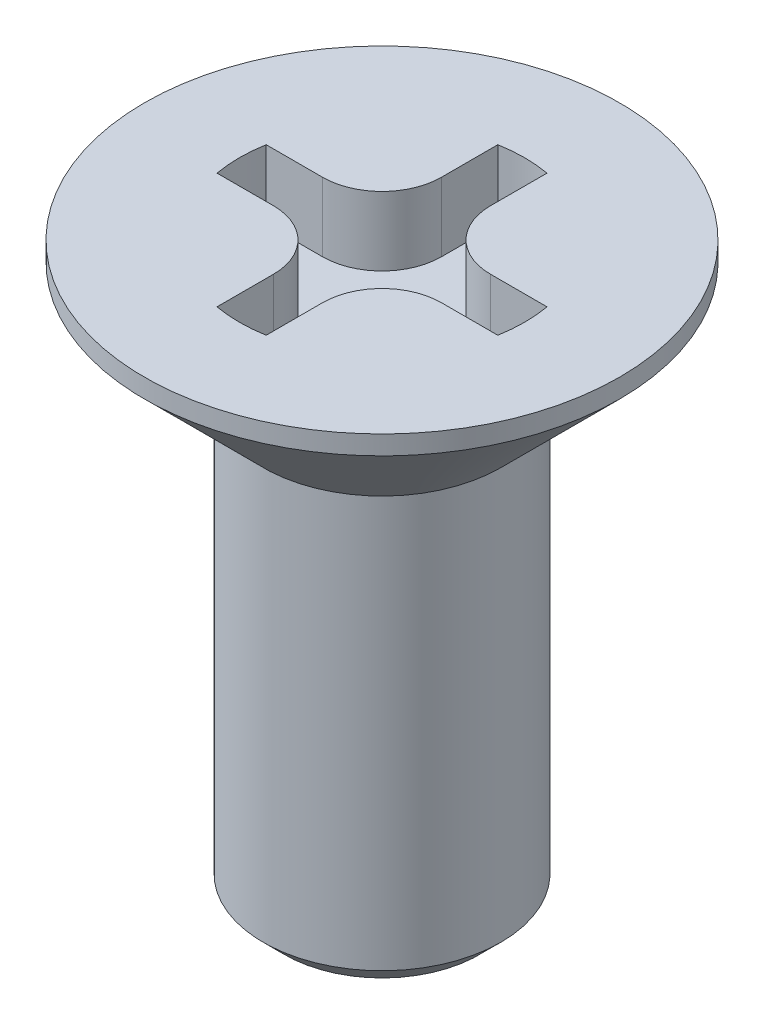
ISO-10303-21;
HEADER;
FILE_DESCRIPTION(('STEP AP214'),'2;1');
FILE_NAME('part.step','',(''),(''),'','','');
FILE_SCHEMA(('AUTOMOTIVE_DESIGN { 1 0 10303 214 1 1 1 1 }'));
ENDSEC;
DATA;
#1=APPLICATION_CONTEXT('core data for automotive mechanical design processes');
#2=APPLICATION_PROTOCOL_DEFINITION('international standard','automotive_design',2000,#1);
#3=PRODUCT_CONTEXT('',#1,'mechanical');
#4=PRODUCT('Part','Part','',(#3));
#5=PRODUCT_RELATED_PRODUCT_CATEGORY('part','',(#4));
#6=PRODUCT_DEFINITION_FORMATION('','',#4);
#7=PRODUCT_DEFINITION_CONTEXT('part definition',#1,'design');
#8=PRODUCT_DEFINITION('design','',#6,#7);
#9=PRODUCT_DEFINITION_SHAPE('','',#8);
#10=(LENGTH_UNIT() NAMED_UNIT(*) SI_UNIT(.MILLI.,.METRE.));
#11=(NAMED_UNIT(*) PLANE_ANGLE_UNIT() SI_UNIT($,.RADIAN.));
#12=(NAMED_UNIT(*) SI_UNIT($,.STERADIAN.) SOLID_ANGLE_UNIT());
#13=UNCERTAINTY_MEASURE_WITH_UNIT(LENGTH_MEASURE(1.E-05),#10,'distance_accuracy_value','');
#14=(GEOMETRIC_REPRESENTATION_CONTEXT(3) GLOBAL_UNCERTAINTY_ASSIGNED_CONTEXT((#13)) GLOBAL_UNIT_ASSIGNED_CONTEXT((#10,
#11,#12)) REPRESENTATION_CONTEXT('',''));
#15=CARTESIAN_POINT('',(0.,0.,0.));
#16=DIRECTION('',(0.,0.,1.));
#17=DIRECTION('',(1.,0.,0.));
#18=AXIS2_PLACEMENT_3D('',#15,#16,#17);
#19=CARTESIAN_POINT('',(0.,0.725,0.));
#20=DIRECTION('',(0.,-1.,0.));
#21=DIRECTION('',(0.,0.,-1.));
#22=AXIS2_PLACEMENT_3D('',#19,#20,#21);
#23=PLANE('',#22);
#24=DIRECTION('',(-1.,0.,0.));
#25=VECTOR('',#24,1.);
#26=CARTESIAN_POINT('',(-0.8838834764832,0.725,0.2588834764832));
#27=LINE('',#26,#25);
#28=CARTESIAN_POINT('',(-0.8838834764832,0.725,0.2588834764832));
#29=VERTEX_POINT('',#28);
#30=CARTESIAN_POINT('',(-1.477490895269,0.725,0.2588834764832));
#31=VERTEX_POINT('',#30);
#32=EDGE_CURVE('E207',#29,#31,#27,.T.);
#33=ORIENTED_EDGE('',*,*,#32,.F.);
#34=CARTESIAN_POINT('',(-0.8838834764832,0.725,0.8838834764832));
#35=DIRECTION('',(0.,1.,0.));
#36=DIRECTION('',(1.,0.,0.));
#37=AXIS2_PLACEMENT_3D('',#34,#35,#36);
#38=CIRCLE('',#37,0.625);
#39=CARTESIAN_POINT('',(-0.2588834764832,0.725,0.8838834764832));
#40=VERTEX_POINT('',#39);
#41=EDGE_CURVE('E11',#40,#29,#38,.T.);
#42=ORIENTED_EDGE('',*,*,#41,.F.);
#43=DIRECTION('',(0.,0.,-1.));
#44=VECTOR('',#43,1.);
#45=CARTESIAN_POINT('',(-0.2588834764832,0.725,1.477490895269));
#46=LINE('',#45,#44);
#47=CARTESIAN_POINT('',(-0.2588834764832,0.725,1.477490895269));
#48=VERTEX_POINT('',#47);
#49=EDGE_CURVE('E20',#48,#40,#46,.T.);
#50=ORIENTED_EDGE('',*,*,#49,.F.);
#51=CARTESIAN_POINT('',(0.,0.725,0.));
#52=DIRECTION('',(0.,-1.,0.));
#53=DIRECTION('',(0.172588984322101,0.,0.984993930179606));
#54=AXIS2_PLACEMENT_3D('',#51,#52,#53);
#55=CIRCLE('',#54,1.5);
#56=CARTESIAN_POINT('',(0.2588834764832,0.725,1.477490895269));
#57=VERTEX_POINT('',#56);
#58=EDGE_CURVE('E411',#57,#48,#55,.T.);
#59=ORIENTED_EDGE('',*,*,#58,.F.);
#60=DIRECTION('',(0.,0.,1.));
#61=VECTOR('',#60,1.);
#62=CARTESIAN_POINT('',(0.2588834764832,0.725,0.8838834764832));
#63=LINE('',#62,#61);
#64=CARTESIAN_POINT('',(0.2588834764832,0.725,0.8838834764832));
#65=VERTEX_POINT('',#64);
#66=EDGE_CURVE('E360',#65,#57,#63,.T.);
#67=ORIENTED_EDGE('',*,*,#66,.F.);
#68=CARTESIAN_POINT('',(0.8838834764832,0.725,0.8838834764832));
#69=DIRECTION('',(0.,1.,0.));
#70=DIRECTION('',(0.,0.,-1.));
#71=AXIS2_PLACEMENT_3D('',#68,#69,#70);
#72=CIRCLE('',#71,0.625);
#73=CARTESIAN_POINT('',(0.8838834764832,0.725,0.2588834764832));
#74=VERTEX_POINT('',#73);
#75=EDGE_CURVE('E361',#74,#65,#72,.T.);
#76=ORIENTED_EDGE('',*,*,#75,.F.);
#77=DIRECTION('',(-1.,0.,0.));
#78=VECTOR('',#77,1.);
#79=CARTESIAN_POINT('',(1.477490895269,0.725,0.2588834764832));
#80=LINE('',#79,#78);
#81=CARTESIAN_POINT('',(1.477490895269,0.725,0.2588834764832));
#82=VERTEX_POINT('',#81);
#83=EDGE_CURVE('E395',#82,#74,#80,.T.);
#84=ORIENTED_EDGE('',*,*,#83,.F.);
#85=CARTESIAN_POINT('',(0.,0.725,0.));
#86=DIRECTION('',(0.,-1.,0.));
#87=DIRECTION('',(0.984993930179606,0.,-0.172588984322101));
#88=AXIS2_PLACEMENT_3D('',#85,#86,#87);
#89=CIRCLE('',#88,1.5);
#90=CARTESIAN_POINT('',(1.477490895269,0.725,-0.2588834764832));
#91=VERTEX_POINT('',#90);
#92=EDGE_CURVE('E345',#91,#82,#89,.T.);
#93=ORIENTED_EDGE('',*,*,#92,.F.);
#94=DIRECTION('',(1.,0.,0.));
#95=VECTOR('',#94,1.);
#96=CARTESIAN_POINT('',(0.8838834764832,0.725,-0.2588834764832));
#97=LINE('',#96,#95);
#98=CARTESIAN_POINT('',(0.8838834764832,0.725,-0.2588834764832));
#99=VERTEX_POINT('',#98);
#100=EDGE_CURVE('E245',#99,#91,#97,.T.);
#101=ORIENTED_EDGE('',*,*,#100,.F.);
#102=CARTESIAN_POINT('',(0.8838834764832,0.725,-0.8838834764832));
#103=DIRECTION('',(0.,1.,0.));
#104=DIRECTION('',(-1.,0.,0.));
#105=AXIS2_PLACEMENT_3D('',#102,#103,#104);
#106=CIRCLE('',#105,0.625);
#107=CARTESIAN_POINT('',(0.2588834764832,0.725,-0.8838834764832));
#108=VERTEX_POINT('',#107);
#109=EDGE_CURVE('E340',#108,#99,#106,.T.);
#110=ORIENTED_EDGE('',*,*,#109,.F.);
#111=DIRECTION('',(0.,0.,1.));
#112=VECTOR('',#111,1.);
#113=CARTESIAN_POINT('',(0.2588834764832,0.725,-1.477490895269));
#114=LINE('',#113,#112);
#115=CARTESIAN_POINT('',(0.2588834764832,0.725,-1.477490895269));
#116=VERTEX_POINT('',#115);
#117=EDGE_CURVE('E299',#116,#108,#114,.T.);
#118=ORIENTED_EDGE('',*,*,#117,.F.);
#119=CARTESIAN_POINT('',(0.,0.725,0.));
#120=DIRECTION('',(0.,-1.,0.));
#121=DIRECTION('',(-0.172588984322101,0.,-0.984993930179606));
#122=AXIS2_PLACEMENT_3D('',#119,#120,#121);
#123=CIRCLE('',#122,1.5);
#124=CARTESIAN_POINT('',(-0.2588834764832,0.725,-1.477490895269));
#125=VERTEX_POINT('',#124);
#126=EDGE_CURVE('E300',#125,#116,#123,.T.);
#127=ORIENTED_EDGE('',*,*,#126,.F.);
#128=DIRECTION('',(0.,0.,-1.));
#129=VECTOR('',#128,1.);
#130=CARTESIAN_POINT('',(-0.2588834764832,0.725,-0.8838834764832));
#131=LINE('',#130,#129);
#132=CARTESIAN_POINT('',(-0.2588834764832,0.725,-0.8838834764832));
#133=VERTEX_POINT('',#132);
#134=EDGE_CURVE('E377',#133,#125,#131,.T.);
#135=ORIENTED_EDGE('',*,*,#134,.F.);
#136=CARTESIAN_POINT('',(-0.8838834764832,0.725,-0.8838834764832));
#137=DIRECTION('',(0.,1.,0.));
#138=DIRECTION('',(0.,0.,1.));
#139=AXIS2_PLACEMENT_3D('',#136,#137,#138);
#140=CIRCLE('',#139,0.625);
#141=CARTESIAN_POINT('',(-0.8838834764832,0.725,-0.2588834764832));
#142=VERTEX_POINT('',#141);
#143=EDGE_CURVE('E292',#142,#133,#140,.T.);
#144=ORIENTED_EDGE('',*,*,#143,.F.);
#145=DIRECTION('',(1.,0.,0.));
#146=VECTOR('',#145,1.);
#147=CARTESIAN_POINT('',(-1.477490895269,0.725,-0.2588834764832));
#148=LINE('',#147,#146);
#149=CARTESIAN_POINT('',(-1.477490895269,0.725,-0.2588834764832));
#150=VERTEX_POINT('',#149);
#151=EDGE_CURVE('E293',#150,#142,#148,.T.);
#152=ORIENTED_EDGE('',*,*,#151,.F.);
#153=CARTESIAN_POINT('',(0.,0.725,0.));
#154=DIRECTION('',(0.,-1.,0.));
#155=DIRECTION('',(-0.984993930179606,0.,0.172588984322101));
#156=AXIS2_PLACEMENT_3D('',#153,#154,#155);
#157=CIRCLE('',#156,1.5);
#158=EDGE_CURVE('E356',#31,#150,#157,.T.);
#159=ORIENTED_EDGE('',*,*,#158,.F.);
#160=EDGE_LOOP('',(#33,#42,#50,#59,#67,#76,#84,#93,#101,#110,#118,#127,#135,#144,#152,#159));
#161=FACE_BOUND('',#160,.T.);
#162=ADVANCED_FACE('F17',(#161),#23,.F.);
#163=CARTESIAN_POINT('',(-0.8838834764832,0.725,0.8838834764832));
#164=DIRECTION('',(0.,-1.,0.));
#165=DIRECTION('',(1.,0.,0.));
#166=AXIS2_PLACEMENT_3D('',#163,#164,#165);
#167=CYLINDRICAL_SURFACE('',#166,0.625);
#168=CARTESIAN_POINT('',(-0.8838834764832,1.45,0.8838834764832));
#169=DIRECTION('',(0.,1.,0.));
#170=DIRECTION('',(1.,0.,0.));
#171=AXIS2_PLACEMENT_3D('',#168,#169,#170);
#172=CIRCLE('',#171,0.625);
#173=CARTESIAN_POINT('',(-0.2588834764832,1.45,0.8838834764832));
#174=VERTEX_POINT('',#173);
#175=CARTESIAN_POINT('',(-0.8838834764832,1.45,0.2588834764832));
#176=VERTEX_POINT('',#175);
#177=EDGE_CURVE('E201',#174,#176,#172,.T.);
#178=ORIENTED_EDGE('',*,*,#177,.F.);
#179=DIRECTION('',(0.,1.,0.));
#180=VECTOR('',#179,1.);
#181=CARTESIAN_POINT('',(-0.2588834764832,0.725,0.8838834764832));
#182=LINE('',#181,#180);
#183=EDGE_CURVE('E26',#40,#174,#182,.T.);
#184=ORIENTED_EDGE('',*,*,#183,.F.);
#185=ORIENTED_EDGE('',*,*,#41,.T.);
#186=DIRECTION('',(0.,1.,0.));
#187=VECTOR('',#186,1.);
#188=CARTESIAN_POINT('',(-0.8838834764832,0.725,0.2588834764832));
#189=LINE('',#188,#187);
#190=EDGE_CURVE('E198',#29,#176,#189,.T.);
#191=ORIENTED_EDGE('',*,*,#190,.T.);
#192=EDGE_LOOP('',(#178,#184,#185,#191));
#193=FACE_BOUND('',#192,.T.);
#194=ADVANCED_FACE('F200',(#193),#167,.T.);
#195=CARTESIAN_POINT('',(-0.2588834764832,0.725,1.477490895269));
#196=DIRECTION('',(-1.,0.,0.));
#197=DIRECTION('',(0.,0.,1.));
#198=AXIS2_PLACEMENT_3D('',#195,#196,#197);
#199=PLANE('',#198);
#200=DIRECTION('',(0.,0.,-1.));
#201=VECTOR('',#200,1.);
#202=CARTESIAN_POINT('',(-0.2588834764832,1.45,1.477490895269));
#203=LINE('',#202,#201);
#204=CARTESIAN_POINT('',(-0.2588834764832,1.45,1.477490895269));
#205=VERTEX_POINT('',#204);
#206=EDGE_CURVE('E217',#205,#174,#203,.T.);
#207=ORIENTED_EDGE('',*,*,#206,.F.);
#208=DIRECTION('',(0.,1.,0.));
#209=VECTOR('',#208,1.);
#210=CARTESIAN_POINT('',(-0.2588834764832,0.725,1.477490895269));
#211=LINE('',#210,#209);
#212=EDGE_CURVE('E414',#48,#205,#211,.T.);
#213=ORIENTED_EDGE('',*,*,#212,.F.);
#214=ORIENTED_EDGE('',*,*,#49,.T.);
#215=ORIENTED_EDGE('',*,*,#183,.T.);
#216=EDGE_LOOP('',(#207,#213,#214,#215));
#217=FACE_BOUND('',#216,.T.);
#218=ADVANCED_FACE('F423',(#217),#199,.F.);
#219=CARTESIAN_POINT('',(0.,0.725,0.));
#220=DIRECTION('',(0.,-1.,0.));
#221=DIRECTION('',(1.,0.,0.));
#222=AXIS2_PLACEMENT_3D('',#219,#220,#221);
#223=CYLINDRICAL_SURFACE('',#222,1.5);
#224=CARTESIAN_POINT('',(0.,1.45,0.));
#225=DIRECTION('',(0.,-1.,0.));
#226=DIRECTION('',(0.172588984322101,0.,0.984993930179606));
#227=AXIS2_PLACEMENT_3D('',#224,#225,#226);
#228=CIRCLE('',#227,1.5);
#229=CARTESIAN_POINT('',(0.2588834764832,1.45,1.477490895269));
#230=VERTEX_POINT('',#229);
#231=EDGE_CURVE('E335',#230,#205,#228,.T.);
#232=ORIENTED_EDGE('',*,*,#231,.F.);
#233=DIRECTION('',(0.,1.,0.));
#234=VECTOR('',#233,1.);
#235=CARTESIAN_POINT('',(0.2588834764832,0.725,1.477490895269));
#236=LINE('',#235,#234);
#237=EDGE_CURVE('E408',#57,#230,#236,.T.);
#238=ORIENTED_EDGE('',*,*,#237,.F.);
#239=ORIENTED_EDGE('',*,*,#58,.T.);
#240=ORIENTED_EDGE('',*,*,#212,.T.);
#241=EDGE_LOOP('',(#232,#238,#239,#240));
#242=FACE_BOUND('',#241,.T.);
#243=ADVANCED_FACE('F425',(#242),#223,.F.);
#244=CARTESIAN_POINT('',(0.2588834764832,0.725,0.8838834764832));
#245=DIRECTION('',(1.,0.,0.));
#246=DIRECTION('',(0.,1.,0.));
#247=AXIS2_PLACEMENT_3D('',#244,#245,#246);
#248=PLANE('',#247);
#249=DIRECTION('',(0.,0.,1.));
#250=VECTOR('',#249,1.);
#251=CARTESIAN_POINT('',(0.2588834764832,1.45,0.8838834764832));
#252=LINE('',#251,#250);
#253=CARTESIAN_POINT('',(0.2588834764832,1.45,0.8838834764832));
#254=VERTEX_POINT('',#253);
#255=EDGE_CURVE('E331',#254,#230,#252,.T.);
#256=ORIENTED_EDGE('',*,*,#255,.F.);
#257=DIRECTION('',(0.,1.,0.));
#258=VECTOR('',#257,1.);
#259=CARTESIAN_POINT('',(0.2588834764832,0.725,0.8838834764832));
#260=LINE('',#259,#258);
#261=EDGE_CURVE('E357',#65,#254,#260,.T.);
#262=ORIENTED_EDGE('',*,*,#261,.F.);
#263=ORIENTED_EDGE('',*,*,#66,.T.);
#264=ORIENTED_EDGE('',*,*,#237,.T.);
#265=EDGE_LOOP('',(#256,#262,#263,#264));
#266=FACE_BOUND('',#265,.T.);
#267=ADVANCED_FACE('F430',(#266),#248,.F.);
#268=CARTESIAN_POINT('',(0.8838834764832,0.725,0.8838834764832));
#269=DIRECTION('',(0.,-1.,0.));
#270=DIRECTION('',(1.,0.,0.));
#271=AXIS2_PLACEMENT_3D('',#268,#269,#270);
#272=CYLINDRICAL_SURFACE('',#271,0.625);
#273=CARTESIAN_POINT('',(0.8838834764832,1.45,0.8838834764832));
#274=DIRECTION('',(0.,1.,0.));
#275=DIRECTION('',(0.,0.,-1.));
#276=AXIS2_PLACEMENT_3D('',#273,#274,#275);
#277=CIRCLE('',#276,0.625);
#278=CARTESIAN_POINT('',(0.8838834764832,1.45,0.2588834764832));
#279=VERTEX_POINT('',#278);
#280=EDGE_CURVE('E327',#279,#254,#277,.T.);
#281=ORIENTED_EDGE('',*,*,#280,.F.);
#282=DIRECTION('',(0.,1.,0.));
#283=VECTOR('',#282,1.);
#284=CARTESIAN_POINT('',(0.8838834764832,0.725,0.2588834764832));
#285=LINE('',#284,#283);
#286=EDGE_CURVE('E399',#74,#279,#285,.T.);
#287=ORIENTED_EDGE('',*,*,#286,.F.);
#288=ORIENTED_EDGE('',*,*,#75,.T.);
#289=ORIENTED_EDGE('',*,*,#261,.T.);
#290=EDGE_LOOP('',(#281,#287,#288,#289));
#291=FACE_BOUND('',#290,.T.);
#292=ADVANCED_FACE('F433',(#291),#272,.T.);
#293=CARTESIAN_POINT('',(1.477490895269,0.725,0.2588834764832));
#294=DIRECTION('',(0.,0.,1.));
#295=DIRECTION('',(1.,0.,0.));
#296=AXIS2_PLACEMENT_3D('',#293,#294,#295);
#297=PLANE('',#296);
#298=DIRECTION('',(-1.,0.,0.));
#299=VECTOR('',#298,1.);
#300=CARTESIAN_POINT('',(1.477490895269,1.45,0.2588834764832));
#301=LINE('',#300,#299);
#302=CARTESIAN_POINT('',(1.477490895269,1.45,0.2588834764832));
#303=VERTEX_POINT('',#302);
#304=EDGE_CURVE('E309',#303,#279,#301,.T.);
#305=ORIENTED_EDGE('',*,*,#304,.F.);
#306=DIRECTION('',(0.,1.,0.));
#307=VECTOR('',#306,1.);
#308=CARTESIAN_POINT('',(1.477490895269,0.725,0.2588834764832));
#309=LINE('',#308,#307);
#310=EDGE_CURVE('E348',#82,#303,#309,.T.);
#311=ORIENTED_EDGE('',*,*,#310,.F.);
#312=ORIENTED_EDGE('',*,*,#83,.T.);
#313=ORIENTED_EDGE('',*,*,#286,.T.);
#314=EDGE_LOOP('',(#305,#311,#312,#313));
#315=FACE_BOUND('',#314,.T.);
#316=ADVANCED_FACE('F437',(#315),#297,.F.);
#317=CARTESIAN_POINT('',(0.,0.725,0.));
#318=DIRECTION('',(0.,-1.,0.));
#319=DIRECTION('',(1.,0.,0.));
#320=AXIS2_PLACEMENT_3D('',#317,#318,#319);
#321=CYLINDRICAL_SURFACE('',#320,1.5);
#322=CARTESIAN_POINT('',(0.,1.45,0.));
#323=DIRECTION('',(0.,-1.,0.));
#324=DIRECTION('',(0.984993930179606,0.,-0.172588984322101));
#325=AXIS2_PLACEMENT_3D('',#322,#323,#324);
#326=CIRCLE('',#325,1.5);
#327=CARTESIAN_POINT('',(1.477490895269,1.45,-0.2588834764832));
#328=VERTEX_POINT('',#327);
#329=EDGE_CURVE('E305',#328,#303,#326,.T.);
#330=ORIENTED_EDGE('',*,*,#329,.F.);
#331=DIRECTION('',(0.,1.,0.));
#332=VECTOR('',#331,1.);
#333=CARTESIAN_POINT('',(1.477490895269,0.725,-0.2588834764832));
#334=LINE('',#333,#332);
#335=EDGE_CURVE('E249',#91,#328,#334,.T.);
#336=ORIENTED_EDGE('',*,*,#335,.F.);
#337=ORIENTED_EDGE('',*,*,#92,.T.);
#338=ORIENTED_EDGE('',*,*,#310,.T.);
#339=EDGE_LOOP('',(#330,#336,#337,#338));
#340=FACE_BOUND('',#339,.T.);
#341=ADVANCED_FACE('F442',(#340),#321,.F.);
#342=CARTESIAN_POINT('',(0.8838834764832,0.725,-0.2588834764832));
#343=DIRECTION('',(0.,0.,-1.));
#344=DIRECTION('',(0.,-1.,0.));
#345=AXIS2_PLACEMENT_3D('',#342,#343,#344);
#346=PLANE('',#345);
#347=DIRECTION('',(0.,1.,0.));
#348=VECTOR('',#347,1.);
#349=CARTESIAN_POINT('',(0.8838834764832,0.725,-0.2588834764832));
#350=LINE('',#349,#348);
#351=CARTESIAN_POINT('',(0.8838834764832,1.45,-0.2588834764832));
#352=VERTEX_POINT('',#351);
#353=EDGE_CURVE('E250',#99,#352,#350,.T.);
#354=ORIENTED_EDGE('',*,*,#353,.F.);
#355=ORIENTED_EDGE('',*,*,#100,.T.);
#356=ORIENTED_EDGE('',*,*,#335,.T.);
#357=DIRECTION('',(1.,0.,0.));
#358=VECTOR('',#357,1.);
#359=CARTESIAN_POINT('',(0.8838834764832,1.45,-0.2588834764832));
#360=LINE('',#359,#358);
#361=EDGE_CURVE('E310',#352,#328,#360,.T.);
#362=ORIENTED_EDGE('',*,*,#361,.F.);
#363=EDGE_LOOP('',(#354,#355,#356,#362));
#364=FACE_BOUND('',#363,.T.);
#365=ADVANCED_FACE('F445',(#364),#346,.F.);
#366=CARTESIAN_POINT('',(0.8838834764832,0.725,-0.8838834764832));
#367=DIRECTION('',(0.,-1.,0.));
#368=DIRECTION('',(1.,0.,0.));
#369=AXIS2_PLACEMENT_3D('',#366,#367,#368);
#370=CYLINDRICAL_SURFACE('',#369,0.625);
#371=DIRECTION('',(0.,1.,0.));
#372=VECTOR('',#371,1.);
#373=CARTESIAN_POINT('',(0.2588834764832,0.725,-0.8838834764832));
#374=LINE('',#373,#372);
#375=CARTESIAN_POINT('',(0.2588834764832,1.45,-0.8838834764832));
#376=VERTEX_POINT('',#375);
#377=EDGE_CURVE('E343',#108,#376,#374,.T.);
#378=ORIENTED_EDGE('',*,*,#377,.F.);
#379=ORIENTED_EDGE('',*,*,#109,.T.);
#380=ORIENTED_EDGE('',*,*,#353,.T.);
#381=CARTESIAN_POINT('',(0.8838834764832,1.45,-0.8838834764832));
#382=DIRECTION('',(0.,-1.,0.));
#383=DIRECTION('',(0.,0.,1.));
#384=AXIS2_PLACEMENT_3D('',#381,#382,#383);
#385=CIRCLE('',#384,0.625);
#386=EDGE_CURVE('E317',#352,#376,#385,.T.);
#387=ORIENTED_EDGE('',*,*,#386,.T.);
#388=EDGE_LOOP('',(#378,#379,#380,#387));
#389=FACE_BOUND('',#388,.T.);
#390=ADVANCED_FACE('F449',(#389),#370,.T.);
#391=CARTESIAN_POINT('',(0.2588834764832,0.725,-1.477490895269));
#392=DIRECTION('',(1.,0.,0.));
#393=DIRECTION('',(0.,1.,0.));
#394=AXIS2_PLACEMENT_3D('',#391,#392,#393);
#395=PLANE('',#394);
#396=DIRECTION('',(0.,1.,0.));
#397=VECTOR('',#396,1.);
#398=CARTESIAN_POINT('',(0.2588834764832,0.725,-1.477490895269));
#399=LINE('',#398,#397);
#400=CARTESIAN_POINT('',(0.2588834764832,1.45,-1.477490895269));
#401=VERTEX_POINT('',#400);
#402=EDGE_CURVE('E297',#116,#401,#399,.T.);
#403=ORIENTED_EDGE('',*,*,#402,.F.);
#404=ORIENTED_EDGE('',*,*,#117,.T.);
#405=ORIENTED_EDGE('',*,*,#377,.T.);
#406=DIRECTION('',(0.,0.,1.));
#407=VECTOR('',#406,1.);
#408=CARTESIAN_POINT('',(0.2588834764832,1.45,-1.477490895269));
#409=LINE('',#408,#407);
#410=EDGE_CURVE('E285',#401,#376,#409,.T.);
#411=ORIENTED_EDGE('',*,*,#410,.F.);
#412=EDGE_LOOP('',(#403,#404,#405,#411));
#413=FACE_BOUND('',#412,.T.);
#414=ADVANCED_FACE('F456',(#413),#395,.F.);
#415=CARTESIAN_POINT('',(0.,0.725,0.));
#416=DIRECTION('',(0.,-1.,0.));
#417=DIRECTION('',(1.,0.,0.));
#418=AXIS2_PLACEMENT_3D('',#415,#416,#417);
#419=CYLINDRICAL_SURFACE('',#418,1.5);
#420=DIRECTION('',(0.,1.,0.));
#421=VECTOR('',#420,1.);
#422=CARTESIAN_POINT('',(-0.2588834764832,0.725,-1.477490895269));
#423=LINE('',#422,#421);
#424=CARTESIAN_POINT('',(-0.2588834764832,1.45,-1.477490895269));
#425=VERTEX_POINT('',#424);
#426=EDGE_CURVE('E381',#125,#425,#423,.T.);
#427=ORIENTED_EDGE('',*,*,#426,.F.);
#428=ORIENTED_EDGE('',*,*,#126,.T.);
#429=ORIENTED_EDGE('',*,*,#402,.T.);
#430=CARTESIAN_POINT('',(0.,1.45,0.));
#431=DIRECTION('',(0.,-1.,0.));
#432=DIRECTION('',(-0.172588984322101,0.,-0.984993930179606));
#433=AXIS2_PLACEMENT_3D('',#430,#431,#432);
#434=CIRCLE('',#433,1.5);
#435=EDGE_CURVE('E270',#425,#401,#434,.T.);
#436=ORIENTED_EDGE('',*,*,#435,.F.);
#437=EDGE_LOOP('',(#427,#428,#429,#436));
#438=FACE_BOUND('',#437,.T.);
#439=ADVANCED_FACE('F459',(#438),#419,.F.);
#440=CARTESIAN_POINT('',(-0.2588834764832,0.725,-0.8838834764832));
#441=DIRECTION('',(-1.,0.,0.));
#442=DIRECTION('',(0.,0.,1.));
#443=AXIS2_PLACEMENT_3D('',#440,#441,#442);
#444=PLANE('',#443);
#445=DIRECTION('',(0.,1.,0.));
#446=VECTOR('',#445,1.);
#447=CARTESIAN_POINT('',(-0.2588834764832,0.725,-0.8838834764832));
#448=LINE('',#447,#446);
#449=CARTESIAN_POINT('',(-0.2588834764832,1.45,-0.8838834764832));
#450=VERTEX_POINT('',#449);
#451=EDGE_CURVE('E374',#133,#450,#448,.T.);
#452=ORIENTED_EDGE('',*,*,#451,.F.);
#453=ORIENTED_EDGE('',*,*,#134,.T.);
#454=ORIENTED_EDGE('',*,*,#426,.T.);
#455=DIRECTION('',(0.,0.,-1.));
#456=VECTOR('',#455,1.);
#457=CARTESIAN_POINT('',(-0.2588834764832,1.45,-0.8838834764832));
#458=LINE('',#457,#456);
#459=EDGE_CURVE('E266',#450,#425,#458,.T.);
#460=ORIENTED_EDGE('',*,*,#459,.F.);
#461=EDGE_LOOP('',(#452,#453,#454,#460));
#462=FACE_BOUND('',#461,.T.);
#463=ADVANCED_FACE('F463',(#462),#444,.F.);
#464=CARTESIAN_POINT('',(-0.8838834764832,0.725,-0.8838834764832));
#465=DIRECTION('',(0.,-1.,0.));
#466=DIRECTION('',(1.,0.,0.));
#467=AXIS2_PLACEMENT_3D('',#464,#465,#466);
#468=CYLINDRICAL_SURFACE('',#467,0.625);
#469=DIRECTION('',(0.,1.,0.));
#470=VECTOR('',#469,1.);
#471=CARTESIAN_POINT('',(-0.8838834764832,0.725,-0.2588834764832));
#472=LINE('',#471,#470);
#473=CARTESIAN_POINT('',(-0.8838834764832,1.45,-0.2588834764832));
#474=VERTEX_POINT('',#473);
#475=EDGE_CURVE('E289',#142,#474,#472,.T.);
#476=ORIENTED_EDGE('',*,*,#475,.F.);
#477=ORIENTED_EDGE('',*,*,#143,.T.);
#478=ORIENTED_EDGE('',*,*,#451,.T.);
#479=CARTESIAN_POINT('',(-0.8838834764832,1.45,-0.8838834764832));
#480=DIRECTION('',(0.,-1.,0.));
#481=DIRECTION('',(1.,0.,0.));
#482=AXIS2_PLACEMENT_3D('',#479,#480,#481);
#483=CIRCLE('',#482,0.625);
#484=EDGE_CURVE('E239',#450,#474,#483,.T.);
#485=ORIENTED_EDGE('',*,*,#484,.T.);
#486=EDGE_LOOP('',(#476,#477,#478,#485));
#487=FACE_BOUND('',#486,.T.);
#488=ADVANCED_FACE('F468',(#487),#468,.T.);
#489=CARTESIAN_POINT('',(-1.477490895269,0.725,-0.2588834764832));
#490=DIRECTION('',(0.,0.,-1.));
#491=DIRECTION('',(0.,-1.,0.));
#492=AXIS2_PLACEMENT_3D('',#489,#490,#491);
#493=PLANE('',#492);
#494=DIRECTION('',(0.,1.,0.));
#495=VECTOR('',#494,1.);
#496=CARTESIAN_POINT('',(-1.477490895269,0.725,-0.2588834764832));
#497=LINE('',#496,#495);
#498=CARTESIAN_POINT('',(-1.477490895269,1.45,-0.2588834764832));
#499=VERTEX_POINT('',#498);
#500=EDGE_CURVE('E365',#150,#499,#497,.T.);
#501=ORIENTED_EDGE('',*,*,#500,.F.);
#502=ORIENTED_EDGE('',*,*,#151,.T.);
#503=ORIENTED_EDGE('',*,*,#475,.T.);
#504=DIRECTION('',(1.,0.,0.));
#505=VECTOR('',#504,1.);
#506=CARTESIAN_POINT('',(-1.477490895269,1.45,-0.2588834764832));
#507=LINE('',#506,#505);
#508=EDGE_CURVE('E232',#499,#474,#507,.T.);
#509=ORIENTED_EDGE('',*,*,#508,.F.);
#510=EDGE_LOOP('',(#501,#502,#503,#509));
#511=FACE_BOUND('',#510,.T.);
#512=ADVANCED_FACE('F472',(#511),#493,.F.);
#513=CARTESIAN_POINT('',(0.,0.725,0.));
#514=DIRECTION('',(0.,-1.,0.));
#515=DIRECTION('',(-1.,0.,0.));
#516=AXIS2_PLACEMENT_3D('',#513,#514,#515);
#517=CYLINDRICAL_SURFACE('',#516,1.5);
#518=CARTESIAN_POINT('',(0.,1.45,0.));
#519=DIRECTION('',(0.,-1.,0.));
#520=DIRECTION('',(-0.984993930179606,0.,0.172588984322101));
#521=AXIS2_PLACEMENT_3D('',#518,#519,#520);
#522=CIRCLE('',#521,1.5);
#523=CARTESIAN_POINT('',(-1.477490895269,1.45,0.2588834764832));
#524=VERTEX_POINT('',#523);
#525=EDGE_CURVE('E225',#524,#499,#522,.T.);
#526=ORIENTED_EDGE('',*,*,#525,.F.);
#527=DIRECTION('',(0.,1.,0.));
#528=VECTOR('',#527,1.);
#529=CARTESIAN_POINT('',(-1.477490895269,0.725,0.2588834764832));
#530=LINE('',#529,#528);
#531=EDGE_CURVE('E222',#31,#524,#530,.T.);
#532=ORIENTED_EDGE('',*,*,#531,.F.);
#533=ORIENTED_EDGE('',*,*,#158,.T.);
#534=ORIENTED_EDGE('',*,*,#500,.T.);
#535=EDGE_LOOP('',(#526,#532,#533,#534));
#536=FACE_BOUND('',#535,.T.);
#537=ADVANCED_FACE('F474',(#536),#517,.F.);
#538=CARTESIAN_POINT('',(-0.8838834764832,0.725,0.2588834764832));
#539=DIRECTION('',(0.,0.,1.));
#540=DIRECTION('',(1.,0.,0.));
#541=AXIS2_PLACEMENT_3D('',#538,#539,#540);
#542=PLANE('',#541);
#543=DIRECTION('',(-1.,0.,0.));
#544=VECTOR('',#543,1.);
#545=CARTESIAN_POINT('',(-0.8838834764832,1.45,0.2588834764832));
#546=LINE('',#545,#544);
#547=EDGE_CURVE('E214',#176,#524,#546,.T.);
#548=ORIENTED_EDGE('',*,*,#547,.F.);
#549=ORIENTED_EDGE('',*,*,#190,.F.);
#550=ORIENTED_EDGE('',*,*,#32,.T.);
#551=ORIENTED_EDGE('',*,*,#531,.T.);
#552=EDGE_LOOP('',(#548,#549,#550,#551));
#553=FACE_BOUND('',#552,.T.);
#554=ADVANCED_FACE('F220',(#553),#542,.F.);
#555=CARTESIAN_POINT('',(0.,1.45,0.));
#556=DIRECTION('',(0.,-1.,0.));
#557=DIRECTION('',(0.,0.,-1.));
#558=AXIS2_PLACEMENT_3D('',#555,#556,#557);
#559=PLANE('',#558);
#560=ORIENTED_EDGE('',*,*,#547,.T.);
#561=ORIENTED_EDGE('',*,*,#525,.T.);
#562=ORIENTED_EDGE('',*,*,#508,.T.);
#563=ORIENTED_EDGE('',*,*,#484,.F.);
#564=ORIENTED_EDGE('',*,*,#459,.T.);
#565=ORIENTED_EDGE('',*,*,#435,.T.);
#566=ORIENTED_EDGE('',*,*,#410,.T.);
#567=ORIENTED_EDGE('',*,*,#386,.F.);
#568=ORIENTED_EDGE('',*,*,#361,.T.);
#569=ORIENTED_EDGE('',*,*,#329,.T.);
#570=ORIENTED_EDGE('',*,*,#304,.T.);
#571=ORIENTED_EDGE('',*,*,#280,.T.);
#572=ORIENTED_EDGE('',*,*,#255,.T.);
#573=ORIENTED_EDGE('',*,*,#231,.T.);
#574=ORIENTED_EDGE('',*,*,#206,.T.);
#575=ORIENTED_EDGE('',*,*,#177,.T.);
#576=EDGE_LOOP('',(#560,#561,#562,#563,#564,#565,#566,#567,#568,#569,#570,#571,#572,#573,#574,#575));
#577=FACE_BOUND('',#576,.T.);
#578=CARTESIAN_POINT('',(0.,1.45,0.));
#579=DIRECTION('',(0.,-1.,0.));
#580=DIRECTION('',(1.,0.,0.));
#581=AXIS2_PLACEMENT_3D('',#578,#579,#580);
#582=CIRCLE('',#581,2.5);
#583=CARTESIAN_POINT('',(2.5,1.45,0.));
#584=VERTEX_POINT('',#583);
#585=EDGE_CURVE('E226',#584,#584,#582,.T.);
#586=ORIENTED_EDGE('',*,*,#585,.F.);
#587=EDGE_LOOP('',(#586));
#588=FACE_BOUND('',#587,.T.);
#589=ADVANCED_FACE('F211',(#577,#588),#559,.F.);
#590=CARTESIAN_POINT('',(0.,1.75,0.));
#591=DIRECTION('',(0.,-1.,0.));
#592=DIRECTION('',(-1.,0.,0.));
#593=AXIS2_PLACEMENT_3D('',#590,#591,#592);
#594=CYLINDRICAL_SURFACE('',#593,2.5);
#595=CARTESIAN_POINT('',(0.,1.25,0.));
#596=DIRECTION('',(0.,-1.,0.));
#597=DIRECTION('',(1.,0.,0.));
#598=AXIS2_PLACEMENT_3D('',#595,#596,#597);
#599=CIRCLE('',#598,2.5);
#600=CARTESIAN_POINT('',(-2.5,1.25,0.));
#601=VERTEX_POINT('',#600);
#602=CARTESIAN_POINT('',(2.5,1.25,0.));
#603=VERTEX_POINT('',#602);
#604=EDGE_CURVE('E260',#601,#603,#599,.T.);
#605=ORIENTED_EDGE('',*,*,#604,.F.);
#606=CARTESIAN_POINT('',(0.,1.25,0.));
#607=DIRECTION('',(0.,-1.,0.));
#608=DIRECTION('',(1.,0.,0.));
#609=AXIS2_PLACEMENT_3D('',#606,#607,#608);
#610=CIRCLE('',#609,2.5);
#611=EDGE_CURVE('E264',#603,#601,#610,.T.);
#612=ORIENTED_EDGE('',*,*,#611,.F.);
#613=DIRECTION('',(0.,1.,0.));
#614=VECTOR('',#613,1.);
#615=CARTESIAN_POINT('',(2.5,1.75,0.));
#616=LINE('',#615,#614);
#617=EDGE_CURVE('E235',#603,#584,#616,.T.);
#618=ORIENTED_EDGE('',*,*,#617,.T.);
#619=ORIENTED_EDGE('',*,*,#585,.T.);
#620=ORIENTED_EDGE('',*,*,#617,.F.);
#621=EDGE_LOOP('',(#605,#612,#618,#619,#620));
#622=FACE_BOUND('',#621,.T.);
#623=ADVANCED_FACE('F536',(#622),#594,.T.);
#624=CARTESIAN_POINT('',(0.,0.625,0.));
#625=DIRECTION('',(0.,1.,0.));
#626=DIRECTION('',(1.,0.,0.));
#627=AXIS2_PLACEMENT_3D('',#624,#625,#626);
#628=CONICAL_SURFACE('',#627,1.875,0.785398163397448);
#629=ORIENTED_EDGE('',*,*,#604,.T.);
#630=ORIENTED_EDGE('',*,*,#611,.T.);
#631=DIRECTION('',(0.707106781186548,-0.707106781186548,0.));
#632=VECTOR('',#631,1.);
#633=CARTESIAN_POINT('',(-1.875,0.625,0.));
#634=LINE('',#633,#632);
#635=CARTESIAN_POINT('',(-1.25,0.,0.));
#636=VERTEX_POINT('',#635);
#637=EDGE_CURVE('E280',#601,#636,#634,.T.);
#638=ORIENTED_EDGE('',*,*,#637,.T.);
#639=CARTESIAN_POINT('',(0.,0.,0.));
#640=DIRECTION('',(0.,-1.,0.));
#641=DIRECTION('',(1.,0.,0.));
#642=AXIS2_PLACEMENT_3D('',#639,#640,#641);
#643=CIRCLE('',#642,1.25);
#644=CARTESIAN_POINT('',(1.25,0.,0.));
#645=VERTEX_POINT('',#644);
#646=EDGE_CURVE('E276',#645,#636,#643,.T.);
#647=ORIENTED_EDGE('',*,*,#646,.F.);
#648=CARTESIAN_POINT('',(0.,0.,0.));
#649=DIRECTION('',(0.,-1.,0.));
#650=DIRECTION('',(1.,0.,0.));
#651=AXIS2_PLACEMENT_3D('',#648,#649,#650);
#652=CIRCLE('',#651,1.25);
#653=EDGE_CURVE('E265',#636,#645,#652,.T.);
#654=ORIENTED_EDGE('',*,*,#653,.F.);
#655=ORIENTED_EDGE('',*,*,#637,.F.);
#656=EDGE_LOOP('',(#629,#630,#638,#647,#654,#655));
#657=FACE_BOUND('',#656,.T.);
#658=ADVANCED_FACE('F532',(#657),#628,.T.);
#659=CARTESIAN_POINT('',(0.,1.75,0.));
#660=DIRECTION('',(0.,-1.,0.));
#661=DIRECTION('',(-1.,0.,0.));
#662=AXIS2_PLACEMENT_3D('',#659,#660,#661);
#663=CYLINDRICAL_SURFACE('',#662,1.25);
#664=CARTESIAN_POINT('',(0.,-4.325,0.));
#665=DIRECTION('',(0.,-1.,0.));
#666=DIRECTION('',(-1.,0.,0.));
#667=AXIS2_PLACEMENT_3D('',#664,#665,#666);
#668=CIRCLE('',#667,1.25);
#669=CARTESIAN_POINT('',(1.25,-4.325,0.));
#670=VERTEX_POINT('',#669);
#671=CARTESIAN_POINT('',(-1.25,-4.325,0.));
#672=VERTEX_POINT('',#671);
#673=EDGE_CURVE('E244',#670,#672,#668,.T.);
#674=ORIENTED_EDGE('',*,*,#673,.F.);
#675=DIRECTION('',(0.,1.,0.));
#676=VECTOR('',#675,1.);
#677=CARTESIAN_POINT('',(1.25,1.75,0.));
#678=LINE('',#677,#676);
#679=EDGE_CURVE('E255',#670,#645,#678,.T.);
#680=ORIENTED_EDGE('',*,*,#679,.T.);
#681=ORIENTED_EDGE('',*,*,#646,.T.);
#682=ORIENTED_EDGE('',*,*,#653,.T.);
#683=ORIENTED_EDGE('',*,*,#679,.F.);
#684=CARTESIAN_POINT('',(0.,-4.325,0.));
#685=DIRECTION('',(0.,-1.,0.));
#686=DIRECTION('',(-1.,0.,0.));
#687=AXIS2_PLACEMENT_3D('',#684,#685,#686);
#688=CIRCLE('',#687,1.25);
#689=EDGE_CURVE('E251',#672,#670,#688,.T.);
#690=ORIENTED_EDGE('',*,*,#689,.F.);
#691=EDGE_LOOP('',(#674,#680,#681,#682,#683,#690));
#692=FACE_BOUND('',#691,.T.);
#693=ADVANCED_FACE('F528',(#692),#663,.T.);
#694=CARTESIAN_POINT('',(0.,-4.4375,0.));
#695=DIRECTION('',(0.,1.,0.));
#696=DIRECTION('',(1.,0.,0.));
#697=AXIS2_PLACEMENT_3D('',#694,#695,#696);
#698=CONICAL_SURFACE('',#697,1.1375,0.785398163397448);
#699=ORIENTED_EDGE('',*,*,#673,.T.);
#700=DIRECTION('',(0.707106781186548,-0.707106781186548,0.));
#701=VECTOR('',#700,1.);
#702=CARTESIAN_POINT('',(-1.1375,-4.4375,0.));
#703=LINE('',#702,#701);
#704=CARTESIAN_POINT('',(-1.025,-4.55,0.));
#705=VERTEX_POINT('',#704);
#706=EDGE_CURVE('E256',#672,#705,#703,.T.);
#707=ORIENTED_EDGE('',*,*,#706,.T.);
#708=CARTESIAN_POINT('',(0.,-4.55,0.));
#709=DIRECTION('',(0.,1.,0.));
#710=DIRECTION('',(1.,0.,0.));
#711=AXIS2_PLACEMENT_3D('',#708,#709,#710);
#712=CIRCLE('',#711,1.025);
#713=EDGE_CURVE('E241',#705,#705,#712,.T.);
#714=ORIENTED_EDGE('',*,*,#713,.T.);
#715=ORIENTED_EDGE('',*,*,#706,.F.);
#716=ORIENTED_EDGE('',*,*,#689,.T.);
#717=EDGE_LOOP('',(#699,#707,#714,#715,#716));
#718=FACE_BOUND('',#717,.T.);
#719=ADVANCED_FACE('F524',(#718),#698,.T.);
#720=CARTESIAN_POINT('',(0.,-4.55,0.));
#721=DIRECTION('',(0.,-1.,0.));
#722=DIRECTION('',(0.,0.,-1.));
#723=AXIS2_PLACEMENT_3D('',#720,#721,#722);
#724=PLANE('',#723);
#725=ORIENTED_EDGE('',*,*,#713,.F.);
#726=EDGE_LOOP('',(#725));
#727=FACE_BOUND('',#726,.T.);
#728=ADVANCED_FACE('F521',(#727),#724,.T.);
#729=CLOSED_SHELL('',(#162,#194,#218,#243,#267,#292,#316,#341,#365,#390,#414,#439,#463,#488,
#512,#537,#554,#589,#623,#658,#693,#719,#728));
#730=MANIFOLD_SOLID_BREP('B1',#729);
#731=ADVANCED_BREP_SHAPE_REPRESENTATION('',(#18,#730),#14);
#732=SHAPE_DEFINITION_REPRESENTATION(#9,#731);
ENDSEC;
END-ISO-10303-21;
